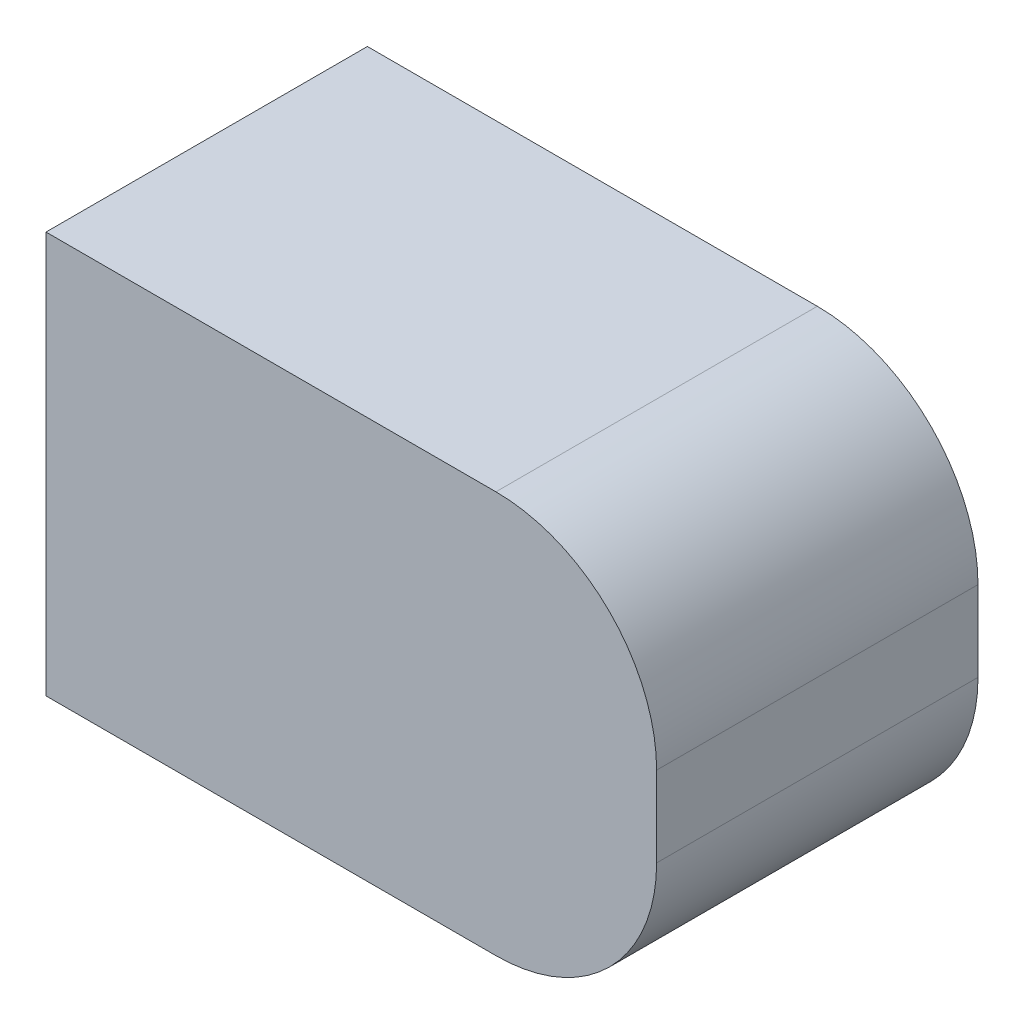
ISO-10303-21;
HEADER;
FILE_DESCRIPTION(('STEP AP214'),'2;1');
FILE_NAME('part.step','',(''),(''),'','','');
FILE_SCHEMA(('AUTOMOTIVE_DESIGN { 1 0 10303 214 1 1 1 1 }'));
ENDSEC;
DATA;
#1=APPLICATION_CONTEXT('core data for automotive mechanical design processes');
#2=APPLICATION_PROTOCOL_DEFINITION('international standard','automotive_design',2000,#1);
#3=PRODUCT_CONTEXT('',#1,'mechanical');
#4=PRODUCT('Part','Part','',(#3));
#5=PRODUCT_RELATED_PRODUCT_CATEGORY('part','',(#4));
#6=PRODUCT_DEFINITION_FORMATION('','',#4);
#7=PRODUCT_DEFINITION_CONTEXT('part definition',#1,'design');
#8=PRODUCT_DEFINITION('design','',#6,#7);
#9=PRODUCT_DEFINITION_SHAPE('','',#8);
#10=(LENGTH_UNIT() NAMED_UNIT(*) SI_UNIT(.MILLI.,.METRE.));
#11=(NAMED_UNIT(*) PLANE_ANGLE_UNIT() SI_UNIT($,.RADIAN.));
#12=(NAMED_UNIT(*) SI_UNIT($,.STERADIAN.) SOLID_ANGLE_UNIT());
#13=UNCERTAINTY_MEASURE_WITH_UNIT(LENGTH_MEASURE(1.E-05),#10,'distance_accuracy_value','');
#14=(GEOMETRIC_REPRESENTATION_CONTEXT(3) GLOBAL_UNCERTAINTY_ASSIGNED_CONTEXT((#13)) GLOBAL_UNIT_ASSIGNED_CONTEXT((#10,
#11,#12)) REPRESENTATION_CONTEXT('',''));
#15=CARTESIAN_POINT('',(0.,0.,0.));
#16=DIRECTION('',(0.,0.,1.));
#17=DIRECTION('',(1.,0.,0.));
#18=AXIS2_PLACEMENT_3D('',#15,#16,#17);
#19=CARTESIAN_POINT('',(-1.223,1.025,0.));
#20=DIRECTION('',(0.,0.,1.));
#21=DIRECTION('',(0.707106781186548,0.707106781186547,0.));
#22=AXIS2_PLACEMENT_3D('',#19,#20,#21);
#23=CYLINDRICAL_SURFACE('',#22,0.1);
#24=CARTESIAN_POINT('',(-1.223,1.025,0.2));
#25=DIRECTION('',(0.,0.,-1.));
#26=DIRECTION('',(0.707106781186548,0.707106781186547,0.));
#27=AXIS2_PLACEMENT_3D('',#24,#25,#26);
#28=CIRCLE('',#27,0.1);
#29=CARTESIAN_POINT('',(-1.223,1.125,0.2));
#30=VERTEX_POINT('',#29);
#31=CARTESIAN_POINT('',(-1.123,1.025,0.2));
#32=VERTEX_POINT('',#31);
#33=EDGE_CURVE('E11',#30,#32,#28,.T.);
#34=ORIENTED_EDGE('',*,*,#33,.T.);
#35=DIRECTION('',(0.,0.,-1.));
#36=VECTOR('',#35,1.);
#37=CARTESIAN_POINT('',(-1.123,1.025,0.));
#38=LINE('',#37,#36);
#39=CARTESIAN_POINT('',(-1.123,1.025,0.));
#40=VERTEX_POINT('',#39);
#41=EDGE_CURVE('E24',#32,#40,#38,.T.);
#42=ORIENTED_EDGE('',*,*,#41,.T.);
#43=CARTESIAN_POINT('',(-1.223,1.025,0.));
#44=DIRECTION('',(0.,0.,1.));
#45=DIRECTION('',(0.707106781186548,0.707106781186547,0.));
#46=AXIS2_PLACEMENT_3D('',#43,#44,#45);
#47=CIRCLE('',#46,0.1);
#48=CARTESIAN_POINT('',(-1.223,1.125,0.));
#49=VERTEX_POINT('',#48);
#50=EDGE_CURVE('E115',#40,#49,#47,.T.);
#51=ORIENTED_EDGE('',*,*,#50,.T.);
#52=DIRECTION('',(0.,0.,1.));
#53=VECTOR('',#52,1.);
#54=CARTESIAN_POINT('',(-1.223,1.125,0.));
#55=LINE('',#54,#53);
#56=EDGE_CURVE('E113',#49,#30,#55,.T.);
#57=ORIENTED_EDGE('',*,*,#56,.T.);
#58=EDGE_LOOP('',(#34,#42,#51,#57));
#59=FACE_BOUND('',#58,.T.);
#60=ADVANCED_FACE('F17',(#59),#23,.T.);
#61=CARTESIAN_POINT('',(-1.313,1.,0.));
#62=DIRECTION('',(0.,0.,1.));
#63=DIRECTION('',(1.,0.,0.));
#64=AXIS2_PLACEMENT_3D('',#61,#62,#63);
#65=PLANE('',#64);
#66=ORIENTED_EDGE('',*,*,#50,.F.);
#67=DIRECTION('',(0.,1.,0.));
#68=VECTOR('',#67,1.);
#69=CARTESIAN_POINT('',(-1.123,0.875,0.));
#70=LINE('',#69,#68);
#71=CARTESIAN_POINT('',(-1.123,0.975000000000014,0.));
#72=VERTEX_POINT('',#71);
#73=EDGE_CURVE('E110',#72,#40,#70,.T.);
#74=ORIENTED_EDGE('',*,*,#73,.F.);
#75=CARTESIAN_POINT('',(-1.223,0.975000000000014,0.));
#76=DIRECTION('',(0.,0.,1.));
#77=DIRECTION('',(0.707106781186565,-0.70710678118653,0.));
#78=AXIS2_PLACEMENT_3D('',#75,#76,#77);
#79=CIRCLE('',#78,0.1);
#80=CARTESIAN_POINT('',(-1.223,0.875000000000014,0.));
#81=VERTEX_POINT('',#80);
#82=EDGE_CURVE('E107',#81,#72,#79,.T.);
#83=ORIENTED_EDGE('',*,*,#82,.F.);
#84=DIRECTION('',(1.,0.,0.));
#85=VECTOR('',#84,1.);
#86=CARTESIAN_POINT('',(-1.503,0.875,0.));
#87=LINE('',#86,#85);
#88=CARTESIAN_POINT('',(-1.503,0.875,0.));
#89=VERTEX_POINT('',#88);
#90=EDGE_CURVE('E105',#89,#81,#87,.T.);
#91=ORIENTED_EDGE('',*,*,#90,.F.);
#92=DIRECTION('',(0.,-1.,0.));
#93=VECTOR('',#92,1.);
#94=CARTESIAN_POINT('',(-1.503,1.125,0.));
#95=LINE('',#94,#93);
#96=CARTESIAN_POINT('',(-1.503,1.125,0.));
#97=VERTEX_POINT('',#96);
#98=EDGE_CURVE('E84',#97,#89,#95,.T.);
#99=ORIENTED_EDGE('',*,*,#98,.F.);
#100=DIRECTION('',(-1.,0.,0.));
#101=VECTOR('',#100,1.);
#102=CARTESIAN_POINT('',(-1.123,1.125,0.));
#103=LINE('',#102,#101);
#104=EDGE_CURVE('E101',#49,#97,#103,.T.);
#105=ORIENTED_EDGE('',*,*,#104,.F.);
#106=EDGE_LOOP('',(#66,#74,#83,#91,#99,#105));
#107=FACE_BOUND('',#106,.T.);
#108=ADVANCED_FACE('F121',(#107),#65,.F.);
#109=CARTESIAN_POINT('',(-1.123,0.875,0.));
#110=DIRECTION('',(1.,0.,0.));
#111=DIRECTION('',(0.,1.,0.));
#112=AXIS2_PLACEMENT_3D('',#109,#110,#111);
#113=PLANE('',#112);
#114=ORIENTED_EDGE('',*,*,#41,.F.);
#115=DIRECTION('',(0.,1.,0.));
#116=VECTOR('',#115,1.);
#117=CARTESIAN_POINT('',(-1.123,0.875,0.2));
#118=LINE('',#117,#116);
#119=CARTESIAN_POINT('',(-1.123,0.975000000000014,0.2));
#120=VERTEX_POINT('',#119);
#121=EDGE_CURVE('E99',#120,#32,#118,.T.);
#122=ORIENTED_EDGE('',*,*,#121,.F.);
#123=DIRECTION('',(0.,0.,1.));
#124=VECTOR('',#123,1.);
#125=CARTESIAN_POINT('',(-1.123,0.975000000000014,0.));
#126=LINE('',#125,#124);
#127=EDGE_CURVE('E96',#72,#120,#126,.T.);
#128=ORIENTED_EDGE('',*,*,#127,.F.);
#129=ORIENTED_EDGE('',*,*,#73,.T.);
#130=EDGE_LOOP('',(#114,#122,#128,#129));
#131=FACE_BOUND('',#130,.T.);
#132=ADVANCED_FACE('F123',(#131),#113,.T.);
#133=CARTESIAN_POINT('',(-1.223,0.975000000000014,0.));
#134=DIRECTION('',(0.,0.,1.));
#135=DIRECTION('',(0.707106781186565,-0.70710678118653,0.));
#136=AXIS2_PLACEMENT_3D('',#133,#134,#135);
#137=CYLINDRICAL_SURFACE('',#136,0.1);
#138=CARTESIAN_POINT('',(-1.223,0.975000000000014,0.2));
#139=DIRECTION('',(0.,0.,-1.));
#140=DIRECTION('',(0.707106781186565,-0.70710678118653,0.));
#141=AXIS2_PLACEMENT_3D('',#138,#139,#140);
#142=CIRCLE('',#141,0.1);
#143=CARTESIAN_POINT('',(-1.223,0.875000000000014,0.2));
#144=VERTEX_POINT('',#143);
#145=EDGE_CURVE('E94',#120,#144,#142,.T.);
#146=ORIENTED_EDGE('',*,*,#145,.T.);
#147=DIRECTION('',(0.,0.,-1.));
#148=VECTOR('',#147,1.);
#149=CARTESIAN_POINT('',(-1.223,0.875000000000014,0.));
#150=LINE('',#149,#148);
#151=EDGE_CURVE('E73',#144,#81,#150,.T.);
#152=ORIENTED_EDGE('',*,*,#151,.T.);
#153=ORIENTED_EDGE('',*,*,#82,.T.);
#154=ORIENTED_EDGE('',*,*,#127,.T.);
#155=EDGE_LOOP('',(#146,#152,#153,#154));
#156=FACE_BOUND('',#155,.T.);
#157=ADVANCED_FACE('F125',(#156),#137,.T.);
#158=CARTESIAN_POINT('',(-1.123,1.125,0.));
#159=DIRECTION('',(0.,1.,0.));
#160=DIRECTION('',(-1.,0.,0.));
#161=AXIS2_PLACEMENT_3D('',#158,#159,#160);
#162=PLANE('',#161);
#163=ORIENTED_EDGE('',*,*,#56,.F.);
#164=ORIENTED_EDGE('',*,*,#104,.T.);
#165=DIRECTION('',(0.,0.,1.));
#166=VECTOR('',#165,1.);
#167=CARTESIAN_POINT('',(-1.503,1.125,0.));
#168=LINE('',#167,#166);
#169=CARTESIAN_POINT('',(-1.503,1.125,0.2));
#170=VERTEX_POINT('',#169);
#171=EDGE_CURVE('E91',#97,#170,#168,.T.);
#172=ORIENTED_EDGE('',*,*,#171,.T.);
#173=DIRECTION('',(-1.,0.,0.));
#174=VECTOR('',#173,1.);
#175=CARTESIAN_POINT('',(-1.123,1.125,0.2));
#176=LINE('',#175,#174);
#177=EDGE_CURVE('E76',#30,#170,#176,.T.);
#178=ORIENTED_EDGE('',*,*,#177,.F.);
#179=EDGE_LOOP('',(#163,#164,#172,#178));
#180=FACE_BOUND('',#179,.T.);
#181=ADVANCED_FACE('F127',(#180),#162,.T.);
#182=CARTESIAN_POINT('',(-1.503,0.875,0.));
#183=DIRECTION('',(0.,-1.,0.));
#184=DIRECTION('',(1.,0.,0.));
#185=AXIS2_PLACEMENT_3D('',#182,#183,#184);
#186=PLANE('',#185);
#187=ORIENTED_EDGE('',*,*,#151,.F.);
#188=DIRECTION('',(1.,0.,0.));
#189=VECTOR('',#188,1.);
#190=CARTESIAN_POINT('',(-1.503,0.875,0.2));
#191=LINE('',#190,#189);
#192=CARTESIAN_POINT('',(-1.503,0.875,0.2));
#193=VERTEX_POINT('',#192);
#194=EDGE_CURVE('E67',#193,#144,#191,.T.);
#195=ORIENTED_EDGE('',*,*,#194,.F.);
#196=DIRECTION('',(0.,0.,1.));
#197=VECTOR('',#196,1.);
#198=CARTESIAN_POINT('',(-1.503,0.875,0.));
#199=LINE('',#198,#197);
#200=EDGE_CURVE('E71',#89,#193,#199,.T.);
#201=ORIENTED_EDGE('',*,*,#200,.F.);
#202=ORIENTED_EDGE('',*,*,#90,.T.);
#203=EDGE_LOOP('',(#187,#195,#201,#202));
#204=FACE_BOUND('',#203,.T.);
#205=ADVANCED_FACE('F69',(#204),#186,.T.);
#206=CARTESIAN_POINT('',(-1.503,1.125,0.));
#207=DIRECTION('',(-1.,0.,0.));
#208=DIRECTION('',(0.,-1.,0.));
#209=AXIS2_PLACEMENT_3D('',#206,#207,#208);
#210=PLANE('',#209);
#211=ORIENTED_EDGE('',*,*,#98,.T.);
#212=ORIENTED_EDGE('',*,*,#200,.T.);
#213=DIRECTION('',(0.,-1.,0.));
#214=VECTOR('',#213,1.);
#215=CARTESIAN_POINT('',(-1.503,1.125,0.2));
#216=LINE('',#215,#214);
#217=EDGE_CURVE('E83',#170,#193,#216,.T.);
#218=ORIENTED_EDGE('',*,*,#217,.F.);
#219=ORIENTED_EDGE('',*,*,#171,.F.);
#220=EDGE_LOOP('',(#211,#212,#218,#219));
#221=FACE_BOUND('',#220,.T.);
#222=ADVANCED_FACE('F81',(#221),#210,.T.);
#223=CARTESIAN_POINT('',(-1.313,1.,0.2));
#224=DIRECTION('',(0.,0.,1.));
#225=DIRECTION('',(1.,0.,0.));
#226=AXIS2_PLACEMENT_3D('',#223,#224,#225);
#227=PLANE('',#226);
#228=ORIENTED_EDGE('',*,*,#33,.F.);
#229=ORIENTED_EDGE('',*,*,#177,.T.);
#230=ORIENTED_EDGE('',*,*,#217,.T.);
#231=ORIENTED_EDGE('',*,*,#194,.T.);
#232=ORIENTED_EDGE('',*,*,#145,.F.);
#233=ORIENTED_EDGE('',*,*,#121,.T.);
#234=EDGE_LOOP('',(#228,#229,#230,#231,#232,#233));
#235=FACE_BOUND('',#234,.T.);
#236=ADVANCED_FACE('F86',(#235),#227,.T.);
#237=CLOSED_SHELL('',(#60,#108,#132,#157,#181,#205,#222,#236));
#238=MANIFOLD_SOLID_BREP('B1',#237);
#239=ADVANCED_BREP_SHAPE_REPRESENTATION('',(#18,#238),#14);
#240=SHAPE_DEFINITION_REPRESENTATION(#9,#239);
ENDSEC;
END-ISO-10303-21;
